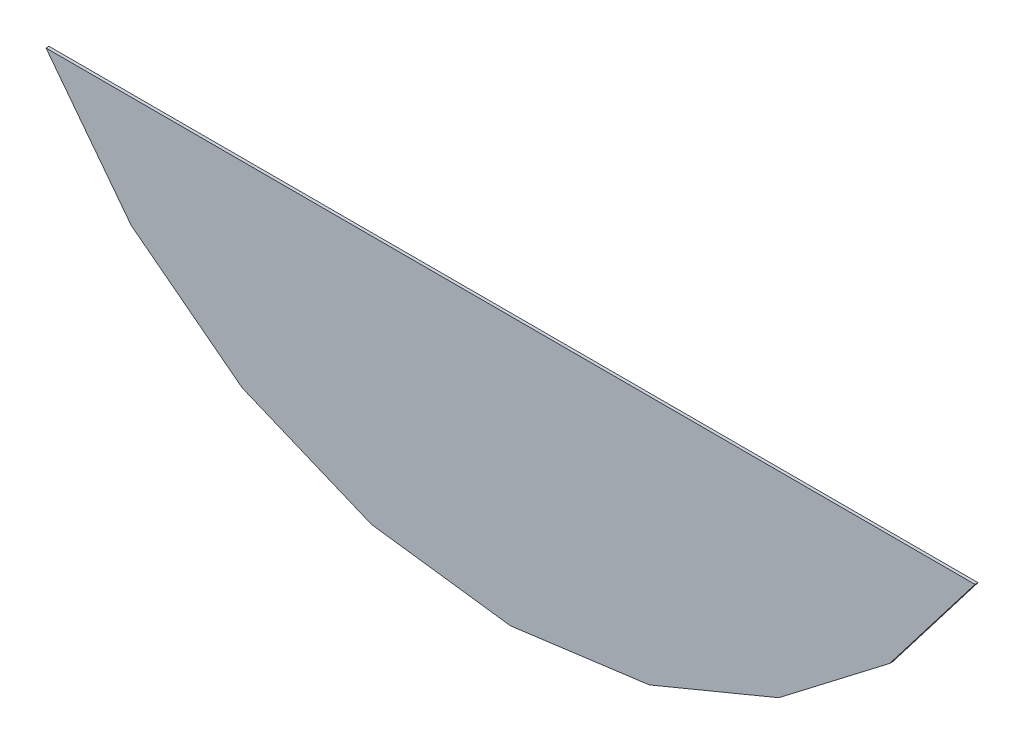
ISO-10303-21;
HEADER;
FILE_DESCRIPTION(('STEP AP214'),'2;1');
FILE_NAME('part.step','',(''),(''),'','','');
FILE_SCHEMA(('AUTOMOTIVE_DESIGN { 1 0 10303 214 1 1 1 1 }'));
ENDSEC;
DATA;
#1=APPLICATION_CONTEXT('core data for automotive mechanical design processes');
#2=APPLICATION_PROTOCOL_DEFINITION('international standard','automotive_design',2000,#1);
#3=PRODUCT_CONTEXT('',#1,'mechanical');
#4=PRODUCT('Part','Part','',(#3));
#5=PRODUCT_RELATED_PRODUCT_CATEGORY('part','',(#4));
#6=PRODUCT_DEFINITION_FORMATION('','',#4);
#7=PRODUCT_DEFINITION_CONTEXT('part definition',#1,'design');
#8=PRODUCT_DEFINITION('design','',#6,#7);
#9=PRODUCT_DEFINITION_SHAPE('','',#8);
#10=(LENGTH_UNIT() NAMED_UNIT(*) SI_UNIT(.MILLI.,.METRE.));
#11=(NAMED_UNIT(*) PLANE_ANGLE_UNIT() SI_UNIT($,.RADIAN.));
#12=(NAMED_UNIT(*) SI_UNIT($,.STERADIAN.) SOLID_ANGLE_UNIT());
#13=UNCERTAINTY_MEASURE_WITH_UNIT(LENGTH_MEASURE(1.E-05),#10,'distance_accuracy_value','');
#14=(GEOMETRIC_REPRESENTATION_CONTEXT(3) GLOBAL_UNCERTAINTY_ASSIGNED_CONTEXT((#13)) GLOBAL_UNIT_ASSIGNED_CONTEXT((#10,
#11,#12)) REPRESENTATION_CONTEXT('',''));
#15=CARTESIAN_POINT('',(0.,0.,0.));
#16=DIRECTION('',(0.,0.,1.));
#17=DIRECTION('',(1.,0.,0.));
#18=AXIS2_PLACEMENT_3D('',#15,#16,#17);
#19=CARTESIAN_POINT('',(-1.5588488,-2.74280376,3.9099998));
#20=DIRECTION('',(0.,0.,1.));
#21=DIRECTION('',(1.,0.,0.));
#22=AXIS2_PLACEMENT_3D('',#19,#20,#21);
#23=PLANE('',#22);
#24=DIRECTION('',(0.923880918501274,0.382680086272127,0.));
#25=VECTOR('',#24,1.);
#26=CARTESIAN_POINT('',(0.465871559999998,-3.58146857999999,3.9099998));
#27=LINE('',#26,#25);
#28=CARTESIAN_POINT('',(0.465871559999994,-3.58146857999999,3.9099998));
#29=VERTEX_POINT('',#28);
#30=CARTESIAN_POINT('',(0.899998200000019,-3.40164928000002,3.9099998));
#31=VERTEX_POINT('',#30);
#32=EDGE_CURVE('E91',#29,#31,#27,.T.);
#33=ORIENTED_EDGE('',*,*,#32,.T.);
#34=DIRECTION('',(0.793350853310934,0.608764670090842,0.));
#35=VECTOR('',#34,1.);
#36=CARTESIAN_POINT('',(0.899998200000011,-3.40164928000002,3.9099998));
#37=LINE('',#36,#35);
#38=CARTESIAN_POINT('',(1.27278891999998,-3.11559447999998,3.9099998));
#39=VERTEX_POINT('',#38);
#40=EDGE_CURVE('E88',#31,#39,#37,.T.);
#41=ORIENTED_EDGE('',*,*,#40,.T.);
#42=DIRECTION('',(0.60876467009081,0.793350853310959,0.));
#43=VECTOR('',#42,1.);
#44=CARTESIAN_POINT('',(1.27278891999998,-3.11559447999999,3.9099998));
#45=LINE('',#44,#43);
#46=CARTESIAN_POINT('',(1.55884372,-2.74280376,3.9099998));
#47=VERTEX_POINT('',#46);
#48=EDGE_CURVE('E20',#39,#47,#45,.T.);
#49=ORIENTED_EDGE('',*,*,#48,.T.);
#50=DIRECTION('',(1.,0.,0.));
#51=VECTOR('',#50,1.);
#52=CARTESIAN_POINT('',(-1.5588488,-2.74280376,3.9099998));
#53=LINE('',#52,#51);
#54=CARTESIAN_POINT('',(-1.55884880000005,-2.74280376000001,3.9099998));
#55=VERTEX_POINT('',#54);
#56=EDGE_CURVE('E94',#55,#47,#53,.T.);
#57=ORIENTED_EDGE('',*,*,#56,.F.);
#58=DIRECTION('',(0.608764670090875,-0.793350853310909,0.));
#59=VECTOR('',#58,1.);
#60=CARTESIAN_POINT('',(-1.55884880000003,-2.74280376000002,3.9099998));
#61=LINE('',#60,#59);
#62=CARTESIAN_POINT('',(-1.27279399999998,-3.11559447999997,3.9099998));
#63=VERTEX_POINT('',#62);
#64=EDGE_CURVE('E84',#55,#63,#61,.T.);
#65=ORIENTED_EDGE('',*,*,#64,.T.);
#66=DIRECTION('',(0.793350853310949,-0.608764670090824,0.));
#67=VECTOR('',#66,1.);
#68=CARTESIAN_POINT('',(-1.27279399999999,-3.11559447999998,3.9099998));
#69=LINE('',#68,#67);
#70=CARTESIAN_POINT('',(-0.900003280000005,-3.40164928000001,3.9099998));
#71=VERTEX_POINT('',#70);
#72=EDGE_CURVE('E105',#63,#71,#69,.T.);
#73=ORIENTED_EDGE('',*,*,#72,.T.);
#74=DIRECTION('',(0.923880918501224,-0.382680086272247,0.));
#75=VECTOR('',#74,1.);
#76=CARTESIAN_POINT('',(-0.900003280000004,-3.40164928000001,3.9099998));
#77=LINE('',#76,#75);
#78=CARTESIAN_POINT('',(-0.465876640000006,-3.58146858000007,3.9099998));
#79=VERTEX_POINT('',#78);
#80=EDGE_CURVE('E106',#71,#79,#77,.T.);
#81=ORIENTED_EDGE('',*,*,#80,.T.);
#82=DIRECTION('',(0.991444891344725,-0.130525964568151,0.));
#83=VECTOR('',#82,1.);
#84=CARTESIAN_POINT('',(-0.465876640000006,-3.58146858000004,3.9099998));
#85=LINE('',#84,#83);
#86=CARTESIAN_POINT('',(-2.54000000913607E-06,-3.64280195999994,3.9099998));
#87=VERTEX_POINT('',#86);
#88=EDGE_CURVE('E110',#79,#87,#85,.T.);
#89=ORIENTED_EDGE('',*,*,#88,.T.);
#90=DIRECTION('',(0.991444891344711,0.130525964568258,0.));
#91=VECTOR('',#90,1.);
#92=CARTESIAN_POINT('',(-2.54000000307793E-06,-3.64280195999996,3.9099998));
#93=LINE('',#92,#91);
#94=EDGE_CURVE('E112',#87,#29,#93,.T.);
#95=ORIENTED_EDGE('',*,*,#94,.T.);
#96=EDGE_LOOP('',(#33,#41,#49,#57,#65,#73,#81,#89,#95));
#97=FACE_BOUND('',#96,.T.);
#98=ADVANCED_FACE('F17',(#97),#23,.T.);
#99=CARTESIAN_POINT('',(-1.5588488,-2.74280376,3.89999982));
#100=DIRECTION('',(0.,1.,0.));
#101=DIRECTION('',(0.,0.,1.));
#102=AXIS2_PLACEMENT_3D('',#99,#100,#101);
#103=PLANE('',#102);
#104=DIRECTION('',(0.,0.,1.));
#105=VECTOR('',#104,1.);
#106=CARTESIAN_POINT('',(-1.55884880000006,-2.74280376000005,3.89999982));
#107=LINE('',#106,#105);
#108=CARTESIAN_POINT('',(-1.55884880000004,-2.74280376000001,3.89999982));
#109=VERTEX_POINT('',#108);
#110=EDGE_CURVE('E116',#55,#109,#107,.F.);
#111=ORIENTED_EDGE('',*,*,#110,.F.);
#112=ORIENTED_EDGE('',*,*,#56,.T.);
#113=DIRECTION('',(0.,0.,1.));
#114=VECTOR('',#113,1.);
#115=CARTESIAN_POINT('',(1.55884372,-2.74280376,3.89999982));
#116=LINE('',#115,#114);
#117=CARTESIAN_POINT('',(1.55884372,-2.74280376,3.89999982));
#118=VERTEX_POINT('',#117);
#119=EDGE_CURVE('E99',#118,#47,#116,.T.);
#120=ORIENTED_EDGE('',*,*,#119,.F.);
#121=DIRECTION('',(1.,0.,0.));
#122=VECTOR('',#121,1.);
#123=CARTESIAN_POINT('',(-1.5588488,-2.74280376,3.89999982));
#124=LINE('',#123,#122);
#125=EDGE_CURVE('E130',#118,#109,#124,.F.);
#126=ORIENTED_EDGE('',*,*,#125,.T.);
#127=EDGE_LOOP('',(#111,#112,#120,#126));
#128=FACE_BOUND('',#127,.T.);
#129=ADVANCED_FACE('F181',(#128),#103,.T.);
#130=CARTESIAN_POINT('',(-1.272794,-3.11559448,3.89999982));
#131=DIRECTION('',(-0.793350853310883,-0.60876467009091,0.));
#132=DIRECTION('',(0.60876467009091,-0.793350853310883,0.));
#133=AXIS2_PLACEMENT_3D('',#130,#131,#132);
#134=PLANE('',#133);
#135=DIRECTION('',(0.,0.,1.));
#136=VECTOR('',#135,1.);
#137=CARTESIAN_POINT('',(-1.27279399999995,-3.11559447999994,3.89999982));
#138=LINE('',#137,#136);
#139=CARTESIAN_POINT('',(-1.27279399999999,-3.11559447999998,3.89999982));
#140=VERTEX_POINT('',#139);
#141=EDGE_CURVE('E118',#63,#140,#138,.F.);
#142=ORIENTED_EDGE('',*,*,#141,.F.);
#143=ORIENTED_EDGE('',*,*,#64,.F.);
#144=ORIENTED_EDGE('',*,*,#110,.T.);
#145=DIRECTION('',(0.608764670090875,-0.793350853310909,0.));
#146=VECTOR('',#145,1.);
#147=CARTESIAN_POINT('',(-1.55884880000003,-2.74280376000002,3.89999982));
#148=LINE('',#147,#146);
#149=EDGE_CURVE('E133',#109,#140,#148,.T.);
#150=ORIENTED_EDGE('',*,*,#149,.T.);
#151=EDGE_LOOP('',(#142,#143,#144,#150));
#152=FACE_BOUND('',#151,.T.);
#153=ADVANCED_FACE('F178',(#152),#134,.T.);
#154=CARTESIAN_POINT('',(-0.90000328,-3.40164928,3.89999982));
#155=DIRECTION('',(-0.60876467009091,-0.793350853310883,0.));
#156=DIRECTION('',(0.793350853310883,-0.60876467009091,0.));
#157=AXIS2_PLACEMENT_3D('',#154,#155,#156);
#158=PLANE('',#157);
#159=DIRECTION('',(0.,0.,1.));
#160=VECTOR('',#159,1.);
#161=CARTESIAN_POINT('',(-0.900003280000014,-3.40164928000003,3.89999982));
#162=LINE('',#161,#160);
#163=CARTESIAN_POINT('',(-0.900003280000004,-3.40164928000001,3.89999982));
#164=VERTEX_POINT('',#163);
#165=EDGE_CURVE('E120',#71,#164,#162,.F.);
#166=ORIENTED_EDGE('',*,*,#165,.F.);
#167=ORIENTED_EDGE('',*,*,#72,.F.);
#168=ORIENTED_EDGE('',*,*,#141,.T.);
#169=DIRECTION('',(0.793350853310949,-0.608764670090823,0.));
#170=VECTOR('',#169,1.);
#171=CARTESIAN_POINT('',(-1.27279399999999,-3.11559447999998,3.89999982));
#172=LINE('',#171,#170);
#173=EDGE_CURVE('E136',#140,#164,#172,.T.);
#174=ORIENTED_EDGE('',*,*,#173,.T.);
#175=EDGE_LOOP('',(#166,#167,#168,#174));
#176=FACE_BOUND('',#175,.T.);
#177=ADVANCED_FACE('F175',(#176),#158,.T.);
#178=CARTESIAN_POINT('',(-0.46587664,-3.58146858,3.89999982));
#179=DIRECTION('',(-0.382680086272115,-0.923880918501279,0.));
#180=DIRECTION('',(0.923880918501279,-0.382680086272115,0.));
#181=AXIS2_PLACEMENT_3D('',#178,#179,#180);
#182=PLANE('',#181);
#183=DIRECTION('',(0.,0.,1.));
#184=VECTOR('',#183,1.);
#185=CARTESIAN_POINT('',(-0.465876640000023,-3.58146858000017,3.89999982));
#186=LINE('',#185,#184);
#187=CARTESIAN_POINT('',(-0.465876640000002,-3.58146858000006,3.89999982));
#188=VERTEX_POINT('',#187);
#189=EDGE_CURVE('E122',#79,#188,#186,.F.);
#190=ORIENTED_EDGE('',*,*,#189,.F.);
#191=ORIENTED_EDGE('',*,*,#80,.F.);
#192=ORIENTED_EDGE('',*,*,#165,.T.);
#193=DIRECTION('',(0.923880918501224,-0.382680086272247,0.));
#194=VECTOR('',#193,1.);
#195=CARTESIAN_POINT('',(-0.900003280000004,-3.40164928000001,3.89999982));
#196=LINE('',#195,#194);
#197=EDGE_CURVE('E139',#164,#188,#196,.T.);
#198=ORIENTED_EDGE('',*,*,#197,.T.);
#199=EDGE_LOOP('',(#190,#191,#192,#198));
#200=FACE_BOUND('',#199,.T.);
#201=ADVANCED_FACE('F170',(#200),#182,.T.);
#202=CARTESIAN_POINT('',(-2.539999996998E-06,-3.64280196,3.89999982));
#203=DIRECTION('',(-0.130525964567967,-0.991444891344749,0.));
#204=DIRECTION('',(0.991444891344749,-0.130525964567967,0.));
#205=AXIS2_PLACEMENT_3D('',#202,#203,#204);
#206=PLANE('',#205);
#207=DIRECTION('',(0.,0.,1.));
#208=VECTOR('',#207,1.);
#209=CARTESIAN_POINT('',(-2.5400000200999E-06,-3.64280195999983,3.89999982));
#210=LINE('',#209,#208);
#211=CARTESIAN_POINT('',(-2.54000000989683E-06,-3.64280195999995,3.89999982));
#212=VERTEX_POINT('',#211);
#213=EDGE_CURVE('E124',#87,#212,#210,.F.);
#214=ORIENTED_EDGE('',*,*,#213,.F.);
#215=ORIENTED_EDGE('',*,*,#88,.F.);
#216=ORIENTED_EDGE('',*,*,#189,.T.);
#217=DIRECTION('',(0.991444891344725,-0.130525964568151,0.));
#218=VECTOR('',#217,1.);
#219=CARTESIAN_POINT('',(-0.465876640000006,-3.58146858000004,3.89999982));
#220=LINE('',#219,#218);
#221=EDGE_CURVE('E142',#188,#212,#220,.T.);
#222=ORIENTED_EDGE('',*,*,#221,.T.);
#223=EDGE_LOOP('',(#214,#215,#216,#222));
#224=FACE_BOUND('',#223,.T.);
#225=ADVANCED_FACE('F165',(#224),#206,.T.);
#226=CARTESIAN_POINT('',(0.46587156,-3.58146858,3.89999982));
#227=DIRECTION('',(0.130525964567967,-0.991444891344749,0.));
#228=DIRECTION('',(0.991444891344749,0.130525964567967,0.));
#229=AXIS2_PLACEMENT_3D('',#226,#227,#228);
#230=PLANE('',#229);
#231=DIRECTION('',(0.,0.,1.));
#232=VECTOR('',#231,1.);
#233=CARTESIAN_POINT('',(0.465871559999989,-3.58146857999997,3.89999982));
#234=LINE('',#233,#232);
#235=CARTESIAN_POINT('',(0.465871559999996,-3.58146857999999,3.89999982));
#236=VERTEX_POINT('',#235);
#237=EDGE_CURVE('E126',#29,#236,#234,.F.);
#238=ORIENTED_EDGE('',*,*,#237,.F.);
#239=ORIENTED_EDGE('',*,*,#94,.F.);
#240=ORIENTED_EDGE('',*,*,#213,.T.);
#241=DIRECTION('',(0.991444891344711,0.130525964568257,0.));
#242=VECTOR('',#241,1.);
#243=CARTESIAN_POINT('',(-2.54000000286109E-06,-3.64280195999996,3.89999982));
#244=LINE('',#243,#242);
#245=EDGE_CURVE('E145',#212,#236,#244,.T.);
#246=ORIENTED_EDGE('',*,*,#245,.T.);
#247=EDGE_LOOP('',(#238,#239,#240,#246));
#248=FACE_BOUND('',#247,.T.);
#249=ADVANCED_FACE('F160',(#248),#230,.T.);
#250=CARTESIAN_POINT('',(0.8999982,-3.40164928,3.89999982));
#251=DIRECTION('',(0.382680086272115,-0.923880918501279,0.));
#252=DIRECTION('',(0.923880918501279,0.382680086272115,0.));
#253=AXIS2_PLACEMENT_3D('',#250,#251,#252);
#254=PLANE('',#253);
#255=DIRECTION('',(0.,0.,1.));
#256=VECTOR('',#255,1.);
#257=CARTESIAN_POINT('',(0.899998200000047,-3.40164928000006,3.89999982));
#258=LINE('',#257,#256);
#259=CARTESIAN_POINT('',(0.899998200000017,-3.40164928000002,3.89999982));
#260=VERTEX_POINT('',#259);
#261=EDGE_CURVE('E100',#31,#260,#258,.F.);
#262=ORIENTED_EDGE('',*,*,#261,.F.);
#263=ORIENTED_EDGE('',*,*,#32,.F.);
#264=ORIENTED_EDGE('',*,*,#237,.T.);
#265=DIRECTION('',(0.923880918501273,0.382680086272128,0.));
#266=VECTOR('',#265,1.);
#267=CARTESIAN_POINT('',(0.465871559999997,-3.58146857999999,3.89999982));
#268=LINE('',#267,#266);
#269=EDGE_CURVE('E148',#236,#260,#268,.T.);
#270=ORIENTED_EDGE('',*,*,#269,.T.);
#271=EDGE_LOOP('',(#262,#263,#264,#270));
#272=FACE_BOUND('',#271,.T.);
#273=ADVANCED_FACE('F153',(#272),#254,.T.);
#274=CARTESIAN_POINT('',(1.27278892,-3.11559448,3.89999982));
#275=DIRECTION('',(0.60876467009091,-0.793350853310883,0.));
#276=DIRECTION('',(0.793350853310883,0.60876467009091,0.));
#277=AXIS2_PLACEMENT_3D('',#274,#275,#276);
#278=PLANE('',#277);
#279=DIRECTION('',(0.,0.,1.));
#280=VECTOR('',#279,1.);
#281=CARTESIAN_POINT('',(1.27278891999994,-3.11559447999995,3.89999982));
#282=LINE('',#281,#280);
#283=CARTESIAN_POINT('',(1.27278891999998,-3.11559447999999,3.89999982));
#284=VERTEX_POINT('',#283);
#285=EDGE_CURVE('E34',#39,#284,#282,.F.);
#286=ORIENTED_EDGE('',*,*,#285,.F.);
#287=ORIENTED_EDGE('',*,*,#40,.F.);
#288=ORIENTED_EDGE('',*,*,#261,.T.);
#289=DIRECTION('',(0.793350853310935,0.608764670090842,0.));
#290=VECTOR('',#289,1.);
#291=CARTESIAN_POINT('',(0.899998200000011,-3.40164928000002,3.89999982));
#292=LINE('',#291,#290);
#293=EDGE_CURVE('E26',#260,#284,#292,.T.);
#294=ORIENTED_EDGE('',*,*,#293,.T.);
#295=EDGE_LOOP('',(#286,#287,#288,#294));
#296=FACE_BOUND('',#295,.T.);
#297=ADVANCED_FACE('F97',(#296),#278,.T.);
#298=CARTESIAN_POINT('',(1.55884372,-2.74280376,3.89999982));
#299=DIRECTION('',(0.793350853310883,-0.60876467009091,0.));
#300=DIRECTION('',(0.60876467009091,0.793350853310883,0.));
#301=AXIS2_PLACEMENT_3D('',#298,#299,#300);
#302=PLANE('',#301);
#303=ORIENTED_EDGE('',*,*,#119,.T.);
#304=ORIENTED_EDGE('',*,*,#48,.F.);
#305=ORIENTED_EDGE('',*,*,#285,.T.);
#306=DIRECTION('',(0.60876467009081,0.793350853310959,0.));
#307=VECTOR('',#306,1.);
#308=CARTESIAN_POINT('',(1.27278891999998,-3.11559447999999,3.89999982));
#309=LINE('',#308,#307);
#310=EDGE_CURVE('E11',#284,#118,#309,.T.);
#311=ORIENTED_EDGE('',*,*,#310,.T.);
#312=EDGE_LOOP('',(#303,#304,#305,#311));
#313=FACE_BOUND('',#312,.T.);
#314=ADVANCED_FACE('F103',(#313),#302,.T.);
#315=CARTESIAN_POINT('',(-1.5588488,-2.74280376,3.89999982));
#316=DIRECTION('',(0.,0.,1.));
#317=DIRECTION('',(1.,0.,0.));
#318=AXIS2_PLACEMENT_3D('',#315,#316,#317);
#319=PLANE('',#318);
#320=ORIENTED_EDGE('',*,*,#293,.F.);
#321=ORIENTED_EDGE('',*,*,#269,.F.);
#322=ORIENTED_EDGE('',*,*,#245,.F.);
#323=ORIENTED_EDGE('',*,*,#221,.F.);
#324=ORIENTED_EDGE('',*,*,#197,.F.);
#325=ORIENTED_EDGE('',*,*,#173,.F.);
#326=ORIENTED_EDGE('',*,*,#149,.F.);
#327=ORIENTED_EDGE('',*,*,#125,.F.);
#328=ORIENTED_EDGE('',*,*,#310,.F.);
#329=EDGE_LOOP('',(#320,#321,#322,#323,#324,#325,#326,#327,#328));
#330=FACE_BOUND('',#329,.T.);
#331=ADVANCED_FACE('F157',(#330),#319,.F.);
#332=CLOSED_SHELL('',(#98,#129,#153,#177,#201,#225,#249,#273,#297,#314,#331));
#333=MANIFOLD_SOLID_BREP('B1',#332);
#334=ADVANCED_BREP_SHAPE_REPRESENTATION('',(#18,#333),#14);
#335=SHAPE_DEFINITION_REPRESENTATION(#9,#334);
ENDSEC;
END-ISO-10303-21;
